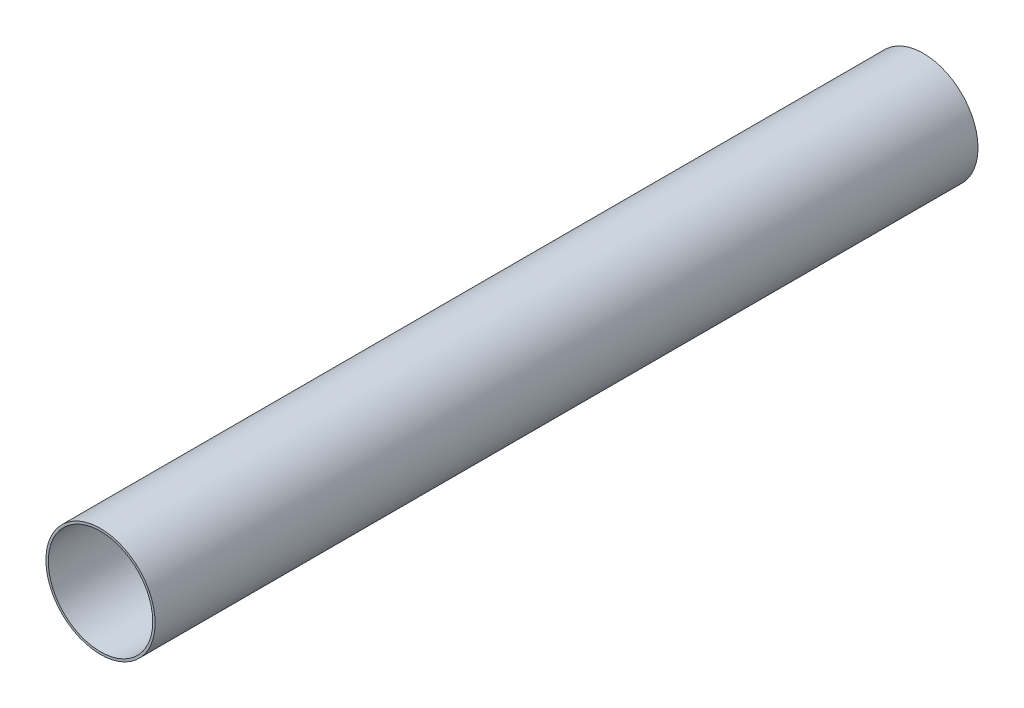
ISO-10303-21;
HEADER;
FILE_DESCRIPTION(('STEP AP214'),'2;1');
FILE_NAME('part.step','',(''),(''),'','','');
FILE_SCHEMA(('AUTOMOTIVE_DESIGN { 1 0 10303 214 1 1 1 1 }'));
ENDSEC;
DATA;
#1=APPLICATION_CONTEXT('core data for automotive mechanical design processes');
#2=APPLICATION_PROTOCOL_DEFINITION('international standard','automotive_design',2000,#1);
#3=PRODUCT_CONTEXT('',#1,'mechanical');
#4=PRODUCT('Part','Part','',(#3));
#5=PRODUCT_RELATED_PRODUCT_CATEGORY('part','',(#4));
#6=PRODUCT_DEFINITION_FORMATION('','',#4);
#7=PRODUCT_DEFINITION_CONTEXT('part definition',#1,'design');
#8=PRODUCT_DEFINITION('design','',#6,#7);
#9=PRODUCT_DEFINITION_SHAPE('','',#8);
#10=(LENGTH_UNIT() NAMED_UNIT(*) SI_UNIT(.MILLI.,.METRE.));
#11=(NAMED_UNIT(*) PLANE_ANGLE_UNIT() SI_UNIT($,.RADIAN.));
#12=(NAMED_UNIT(*) SI_UNIT($,.STERADIAN.) SOLID_ANGLE_UNIT());
#13=UNCERTAINTY_MEASURE_WITH_UNIT(LENGTH_MEASURE(1.E-05),#10,'distance_accuracy_value','');
#14=(GEOMETRIC_REPRESENTATION_CONTEXT(3) GLOBAL_UNCERTAINTY_ASSIGNED_CONTEXT((#13)) GLOBAL_UNIT_ASSIGNED_CONTEXT((#10,
#11,#12)) REPRESENTATION_CONTEXT('',''));
#15=CARTESIAN_POINT('',(0.,0.,0.));
#16=DIRECTION('',(0.,0.,1.));
#17=DIRECTION('',(1.,0.,0.));
#18=AXIS2_PLACEMENT_3D('',#15,#16,#17);
#19=CARTESIAN_POINT('',(0.,0.,400.));
#20=DIRECTION('',(0.,0.,1.));
#21=DIRECTION('',(1.,0.,0.));
#22=AXIS2_PLACEMENT_3D('',#19,#20,#21);
#23=PLANE('',#22);
#24=CARTESIAN_POINT('',(0.,0.,400.));
#25=DIRECTION('',(0.,0.,1.));
#26=DIRECTION('',(1.,0.,0.));
#27=AXIS2_PLACEMENT_3D('',#24,#25,#26);
#28=CIRCLE('',#27,26.545);
#29=CARTESIAN_POINT('',(26.545,0.,400.));
#30=VERTEX_POINT('',#29);
#31=EDGE_CURVE('E10',#30,#30,#28,.T.);
#32=ORIENTED_EDGE('',*,*,#31,.T.);
#33=EDGE_LOOP('',(#32));
#34=FACE_BOUND('',#33,.T.);
#35=CARTESIAN_POINT('',(0.,0.,400.));
#36=DIRECTION('',(0.,0.,1.));
#37=DIRECTION('',(1.,0.,0.));
#38=AXIS2_PLACEMENT_3D('',#35,#36,#37);
#39=CIRCLE('',#38,25.4);
#40=CARTESIAN_POINT('',(25.4,0.,400.));
#41=VERTEX_POINT('',#40);
#42=EDGE_CURVE('E50',#41,#41,#39,.T.);
#43=ORIENTED_EDGE('',*,*,#42,.F.);
#44=EDGE_LOOP('',(#43));
#45=FACE_BOUND('',#44,.T.);
#46=ADVANCED_FACE('F37',(#34,#45),#23,.T.);
#47=CARTESIAN_POINT('',(0.,0.,0.));
#48=DIRECTION('',(0.,0.,1.));
#49=DIRECTION('',(1.,0.,0.));
#50=AXIS2_PLACEMENT_3D('',#47,#48,#49);
#51=PLANE('',#50);
#52=CARTESIAN_POINT('',(0.,0.,0.));
#53=DIRECTION('',(0.,0.,1.));
#54=DIRECTION('',(1.,0.,0.));
#55=AXIS2_PLACEMENT_3D('',#52,#53,#54);
#56=CIRCLE('',#55,26.545);
#57=CARTESIAN_POINT('',(26.545,0.,0.));
#58=VERTEX_POINT('',#57);
#59=EDGE_CURVE('E41',#58,#58,#56,.T.);
#60=ORIENTED_EDGE('',*,*,#59,.F.);
#61=EDGE_LOOP('',(#60));
#62=FACE_BOUND('',#61,.T.);
#63=CARTESIAN_POINT('',(0.,0.,0.));
#64=DIRECTION('',(0.,0.,1.));
#65=DIRECTION('',(1.,0.,0.));
#66=AXIS2_PLACEMENT_3D('',#63,#64,#65);
#67=CIRCLE('',#66,25.4);
#68=CARTESIAN_POINT('',(25.4,0.,0.));
#69=VERTEX_POINT('',#68);
#70=EDGE_CURVE('E52',#69,#69,#67,.T.);
#71=ORIENTED_EDGE('',*,*,#70,.T.);
#72=EDGE_LOOP('',(#71));
#73=FACE_BOUND('',#72,.T.);
#74=ADVANCED_FACE('F64',(#62,#73),#51,.F.);
#75=CARTESIAN_POINT('',(0.,0.,400.));
#76=DIRECTION('',(0.,0.,-1.));
#77=DIRECTION('',(-1.,0.,0.));
#78=AXIS2_PLACEMENT_3D('',#75,#76,#77);
#79=CYLINDRICAL_SURFACE('',#78,26.545);
#80=ORIENTED_EDGE('',*,*,#31,.F.);
#81=EDGE_LOOP('',(#80));
#82=FACE_BOUND('',#81,.T.);
#83=ORIENTED_EDGE('',*,*,#59,.T.);
#84=EDGE_LOOP('',(#83));
#85=FACE_BOUND('',#84,.T.);
#86=ADVANCED_FACE('F39',(#82,#85),#79,.T.);
#87=CARTESIAN_POINT('',(0.,0.,400.));
#88=DIRECTION('',(0.,0.,-1.));
#89=DIRECTION('',(-1.,0.,0.));
#90=AXIS2_PLACEMENT_3D('',#87,#88,#89);
#91=CYLINDRICAL_SURFACE('',#90,25.4);
#92=ORIENTED_EDGE('',*,*,#42,.T.);
#93=EDGE_LOOP('',(#92));
#94=FACE_BOUND('',#93,.T.);
#95=ORIENTED_EDGE('',*,*,#70,.F.);
#96=EDGE_LOOP('',(#95));
#97=FACE_BOUND('',#96,.T.);
#98=ADVANCED_FACE('F60',(#94,#97),#91,.F.);
#99=CLOSED_SHELL('',(#46,#74,#86,#98));
#100=MANIFOLD_SOLID_BREP('B2',#99);
#101=ADVANCED_BREP_SHAPE_REPRESENTATION('',(#18,#100),#14);
#102=SHAPE_DEFINITION_REPRESENTATION(#9,#101);
ENDSEC;
END-ISO-10303-21;
